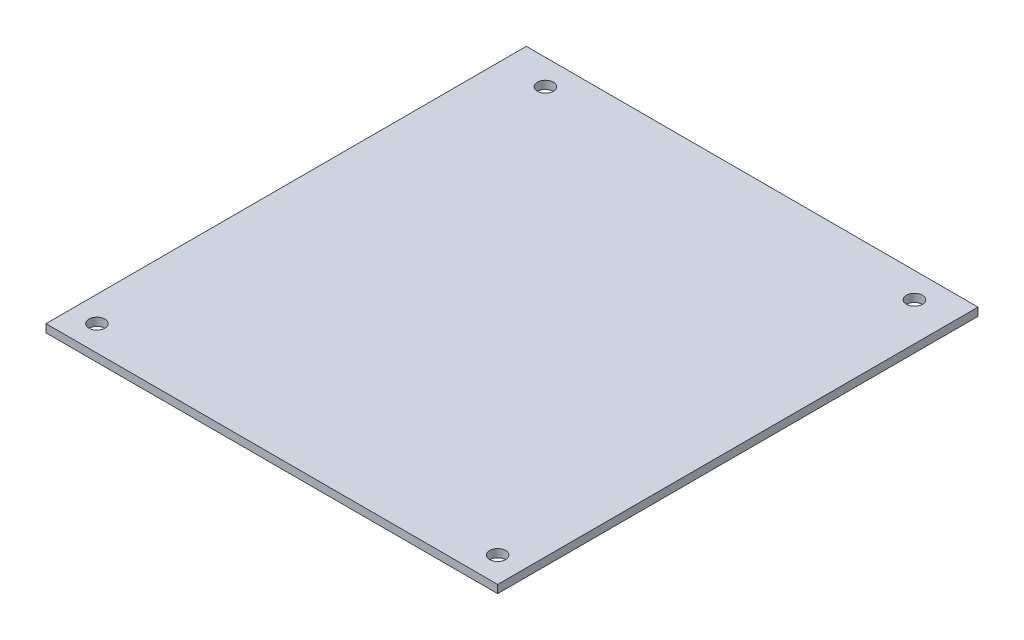
ISO-10303-21;
HEADER;
FILE_DESCRIPTION(('STEP AP214'),'2;1');
FILE_NAME('part.step','',(''),(''),'','','');
FILE_SCHEMA(('AUTOMOTIVE_DESIGN { 1 0 10303 214 1 1 1 1 }'));
ENDSEC;
DATA;
#1=APPLICATION_CONTEXT('core data for automotive mechanical design processes');
#2=APPLICATION_PROTOCOL_DEFINITION('international standard','automotive_design',2000,#1);
#3=PRODUCT_CONTEXT('',#1,'mechanical');
#4=PRODUCT('Part','Part','',(#3));
#5=PRODUCT_RELATED_PRODUCT_CATEGORY('part','',(#4));
#6=PRODUCT_DEFINITION_FORMATION('','',#4);
#7=PRODUCT_DEFINITION_CONTEXT('part definition',#1,'design');
#8=PRODUCT_DEFINITION('design','',#6,#7);
#9=PRODUCT_DEFINITION_SHAPE('','',#8);
#10=(LENGTH_UNIT() NAMED_UNIT(*) SI_UNIT(.MILLI.,.METRE.));
#11=(NAMED_UNIT(*) PLANE_ANGLE_UNIT() SI_UNIT($,.RADIAN.));
#12=(NAMED_UNIT(*) SI_UNIT($,.STERADIAN.) SOLID_ANGLE_UNIT());
#13=UNCERTAINTY_MEASURE_WITH_UNIT(LENGTH_MEASURE(1.E-05),#10,'distance_accuracy_value','');
#14=(GEOMETRIC_REPRESENTATION_CONTEXT(3) GLOBAL_UNCERTAINTY_ASSIGNED_CONTEXT((#13)) GLOBAL_UNIT_ASSIGNED_CONTEXT((#10,
#11,#12)) REPRESENTATION_CONTEXT('',''));
#15=CARTESIAN_POINT('',(0.,0.,0.));
#16=DIRECTION('',(0.,0.,1.));
#17=DIRECTION('',(1.,0.,0.));
#18=AXIS2_PLACEMENT_3D('',#15,#16,#17);
#19=CARTESIAN_POINT('',(0.,17.5,0.));
#20=DIRECTION('',(0.,-1.,0.));
#21=DIRECTION('',(0.,0.,-1.));
#22=AXIS2_PLACEMENT_3D('',#19,#20,#21);
#23=PLANE('',#22);
#24=DIRECTION('',(-1.,0.,0.));
#25=VECTOR('',#24,1.);
#26=CARTESIAN_POINT('',(46.2999999999755,17.5,47.945));
#27=LINE('',#26,#25);
#28=CARTESIAN_POINT('',(45.085,17.5,47.945));
#29=VERTEX_POINT('',#28);
#30=CARTESIAN_POINT('',(-45.085,17.5,47.945));
#31=VERTEX_POINT('',#30);
#32=EDGE_CURVE('E96',#29,#31,#27,.T.);
#33=ORIENTED_EDGE('',*,*,#32,.F.);
#34=DIRECTION('',(0.,0.,-1.));
#35=VECTOR('',#34,1.);
#36=CARTESIAN_POINT('',(45.085,17.5,46.3));
#37=LINE('',#36,#35);
#38=CARTESIAN_POINT('',(45.085,17.5,-47.9449999999993));
#39=VERTEX_POINT('',#38);
#40=EDGE_CURVE('E86',#29,#39,#37,.T.);
#41=ORIENTED_EDGE('',*,*,#40,.T.);
#42=DIRECTION('',(-1.,0.,0.));
#43=VECTOR('',#42,1.);
#44=CARTESIAN_POINT('',(46.2999999999763,17.5,-47.9449999999993));
#45=LINE('',#44,#43);
#46=CARTESIAN_POINT('',(-45.085,17.5,-47.945));
#47=VERTEX_POINT('',#46);
#48=EDGE_CURVE('E81',#39,#47,#45,.T.);
#49=ORIENTED_EDGE('',*,*,#48,.T.);
#50=DIRECTION('',(0.,0.,-1.));
#51=VECTOR('',#50,1.);
#52=CARTESIAN_POINT('',(-45.085,17.5,46.3));
#53=LINE('',#52,#51);
#54=EDGE_CURVE('E85',#31,#47,#53,.T.);
#55=ORIENTED_EDGE('',*,*,#54,.F.);
#56=EDGE_LOOP('',(#33,#41,#49,#55));
#57=FACE_BOUND('',#56,.T.);
#58=CARTESIAN_POINT('',(-36.195,17.5,-42.865));
#59=DIRECTION('',(0.,1.,0.));
#60=DIRECTION('',(0.,0.,1.));
#61=AXIS2_PLACEMENT_3D('',#58,#59,#60);
#62=CIRCLE('',#61,1.59);
#63=CARTESIAN_POINT('',(-36.195,17.5,-41.275));
#64=VERTEX_POINT('',#63);
#65=EDGE_CURVE('E106',#64,#64,#62,.T.);
#66=ORIENTED_EDGE('',*,*,#65,.F.);
#67=EDGE_LOOP('',(#66));
#68=FACE_BOUND('',#67,.T.);
#69=CARTESIAN_POINT('',(-40.005,17.5,42.865));
#70=DIRECTION('',(0.,1.,0.));
#71=DIRECTION('',(0.,0.,1.));
#72=AXIS2_PLACEMENT_3D('',#69,#70,#71);
#73=CIRCLE('',#72,1.59);
#74=CARTESIAN_POINT('',(-40.005,17.5,44.455));
#75=VERTEX_POINT('',#74);
#76=EDGE_CURVE('E149',#75,#75,#73,.T.);
#77=ORIENTED_EDGE('',*,*,#76,.F.);
#78=EDGE_LOOP('',(#77));
#79=FACE_BOUND('',#78,.T.);
#80=CARTESIAN_POINT('',(37.465,17.5,-42.865));
#81=DIRECTION('',(0.,1.,0.));
#82=DIRECTION('',(0.,0.,1.));
#83=AXIS2_PLACEMENT_3D('',#80,#81,#82);
#84=CIRCLE('',#83,1.59);
#85=CARTESIAN_POINT('',(37.465,17.5,-41.275));
#86=VERTEX_POINT('',#85);
#87=EDGE_CURVE('E156',#86,#86,#84,.T.);
#88=ORIENTED_EDGE('',*,*,#87,.F.);
#89=EDGE_LOOP('',(#88));
#90=FACE_BOUND('',#89,.T.);
#91=CARTESIAN_POINT('',(40.005,17.5,42.865));
#92=DIRECTION('',(0.,1.,0.));
#93=DIRECTION('',(0.,0.,1.));
#94=AXIS2_PLACEMENT_3D('',#91,#92,#93);
#95=CIRCLE('',#94,1.59);
#96=CARTESIAN_POINT('',(40.005,17.5,44.455));
#97=VERTEX_POINT('',#96);
#98=EDGE_CURVE('E161',#97,#97,#95,.T.);
#99=ORIENTED_EDGE('',*,*,#98,.F.);
#100=EDGE_LOOP('',(#99));
#101=FACE_BOUND('',#100,.T.);
#102=ADVANCED_FACE('F35',(#57,#68,#79,#90,#101),#23,.F.);
#103=CARTESIAN_POINT('',(0.,15.9,0.));
#104=DIRECTION('',(0.,-1.,0.));
#105=DIRECTION('',(0.,0.,-1.));
#106=AXIS2_PLACEMENT_3D('',#103,#104,#105);
#107=PLANE('',#106);
#108=CARTESIAN_POINT('',(37.465,15.9,-42.865));
#109=DIRECTION('',(0.,1.,0.));
#110=DIRECTION('',(0.,0.,1.));
#111=AXIS2_PLACEMENT_3D('',#108,#109,#110);
#112=CIRCLE('',#111,1.59);
#113=CARTESIAN_POINT('',(37.465,15.9,-41.275));
#114=VERTEX_POINT('',#113);
#115=EDGE_CURVE('E158',#114,#114,#112,.T.);
#116=ORIENTED_EDGE('',*,*,#115,.T.);
#117=EDGE_LOOP('',(#116));
#118=FACE_BOUND('',#117,.T.);
#119=CARTESIAN_POINT('',(-36.195,15.9,-42.865));
#120=DIRECTION('',(0.,1.,0.));
#121=DIRECTION('',(0.,0.,1.));
#122=AXIS2_PLACEMENT_3D('',#119,#120,#121);
#123=CIRCLE('',#122,1.59);
#124=CARTESIAN_POINT('',(-36.195,15.9,-41.275));
#125=VERTEX_POINT('',#124);
#126=EDGE_CURVE('E147',#125,#125,#123,.T.);
#127=ORIENTED_EDGE('',*,*,#126,.T.);
#128=EDGE_LOOP('',(#127));
#129=FACE_BOUND('',#128,.T.);
#130=DIRECTION('',(-1.,0.,0.));
#131=VECTOR('',#130,1.);
#132=CARTESIAN_POINT('',(46.2999999999755,15.9,47.945));
#133=LINE('',#132,#131);
#134=CARTESIAN_POINT('',(45.085,15.9,47.945));
#135=VERTEX_POINT('',#134);
#136=CARTESIAN_POINT('',(-45.085,15.9,47.945));
#137=VERTEX_POINT('',#136);
#138=EDGE_CURVE('E102',#135,#137,#133,.T.);
#139=ORIENTED_EDGE('',*,*,#138,.T.);
#140=DIRECTION('',(0.,0.,-1.));
#141=VECTOR('',#140,1.);
#142=CARTESIAN_POINT('',(-45.085,15.9,46.3));
#143=LINE('',#142,#141);
#144=CARTESIAN_POINT('',(-45.085,15.9,-47.945));
#145=VERTEX_POINT('',#144);
#146=EDGE_CURVE('E105',#137,#145,#143,.T.);
#147=ORIENTED_EDGE('',*,*,#146,.T.);
#148=DIRECTION('',(-1.,0.,0.));
#149=VECTOR('',#148,1.);
#150=CARTESIAN_POINT('',(46.2999999999763,15.9,-47.9449999999993));
#151=LINE('',#150,#149);
#152=CARTESIAN_POINT('',(45.085,15.9,-47.9449999999993));
#153=VERTEX_POINT('',#152);
#154=EDGE_CURVE('E93',#153,#145,#151,.T.);
#155=ORIENTED_EDGE('',*,*,#154,.F.);
#156=DIRECTION('',(0.,0.,-1.));
#157=VECTOR('',#156,1.);
#158=CARTESIAN_POINT('',(45.085,15.9,46.3));
#159=LINE('',#158,#157);
#160=EDGE_CURVE('E69',#135,#153,#159,.T.);
#161=ORIENTED_EDGE('',*,*,#160,.F.);
#162=EDGE_LOOP('',(#139,#147,#155,#161));
#163=FACE_BOUND('',#162,.T.);
#164=CARTESIAN_POINT('',(-40.005,15.9,42.865));
#165=DIRECTION('',(0.,1.,0.));
#166=DIRECTION('',(0.,0.,1.));
#167=AXIS2_PLACEMENT_3D('',#164,#165,#166);
#168=CIRCLE('',#167,1.59);
#169=CARTESIAN_POINT('',(-40.005,15.9,44.455));
#170=VERTEX_POINT('',#169);
#171=EDGE_CURVE('E152',#170,#170,#168,.T.);
#172=ORIENTED_EDGE('',*,*,#171,.T.);
#173=EDGE_LOOP('',(#172));
#174=FACE_BOUND('',#173,.T.);
#175=CARTESIAN_POINT('',(40.005,15.9,42.865));
#176=DIRECTION('',(0.,1.,0.));
#177=DIRECTION('',(0.,0.,1.));
#178=AXIS2_PLACEMENT_3D('',#175,#176,#177);
#179=CIRCLE('',#178,1.59);
#180=CARTESIAN_POINT('',(40.005,15.9,44.455));
#181=VERTEX_POINT('',#180);
#182=EDGE_CURVE('E164',#181,#181,#179,.T.);
#183=ORIENTED_EDGE('',*,*,#182,.T.);
#184=EDGE_LOOP('',(#183));
#185=FACE_BOUND('',#184,.T.);
#186=ADVANCED_FACE('F111',(#118,#129,#163,#174,#185),#107,.T.);
#187=CARTESIAN_POINT('',(46.2999999999755,17.5,47.945));
#188=DIRECTION('',(0.,0.,1.));
#189=DIRECTION('',(1.,0.,0.));
#190=AXIS2_PLACEMENT_3D('',#187,#188,#189);
#191=PLANE('',#190);
#192=ORIENTED_EDGE('',*,*,#138,.F.);
#193=DIRECTION('',(0.,-1.,0.));
#194=VECTOR('',#193,1.);
#195=CARTESIAN_POINT('',(45.085,17.5,47.945));
#196=LINE('',#195,#194);
#197=EDGE_CURVE('E11',#29,#135,#196,.T.);
#198=ORIENTED_EDGE('',*,*,#197,.F.);
#199=ORIENTED_EDGE('',*,*,#32,.T.);
#200=DIRECTION('',(0.,-1.,0.));
#201=VECTOR('',#200,1.);
#202=CARTESIAN_POINT('',(-45.085,17.5,47.945));
#203=LINE('',#202,#201);
#204=EDGE_CURVE('E39',#31,#137,#203,.T.);
#205=ORIENTED_EDGE('',*,*,#204,.T.);
#206=EDGE_LOOP('',(#192,#198,#199,#205));
#207=FACE_BOUND('',#206,.T.);
#208=ADVANCED_FACE('F37',(#207),#191,.T.);
#209=CARTESIAN_POINT('',(45.085,17.5,46.3));
#210=DIRECTION('',(-1.,0.,0.));
#211=DIRECTION('',(0.,0.,1.));
#212=AXIS2_PLACEMENT_3D('',#209,#210,#211);
#213=PLANE('',#212);
#214=ORIENTED_EDGE('',*,*,#160,.T.);
#215=DIRECTION('',(0.,-1.,0.));
#216=VECTOR('',#215,1.);
#217=CARTESIAN_POINT('',(45.085,17.5,-47.9449999999993));
#218=LINE('',#217,#216);
#219=EDGE_CURVE('E45',#39,#153,#218,.T.);
#220=ORIENTED_EDGE('',*,*,#219,.F.);
#221=ORIENTED_EDGE('',*,*,#40,.F.);
#222=ORIENTED_EDGE('',*,*,#197,.T.);
#223=EDGE_LOOP('',(#214,#220,#221,#222));
#224=FACE_BOUND('',#223,.T.);
#225=ADVANCED_FACE('F114',(#224),#213,.F.);
#226=CARTESIAN_POINT('',(46.2999999999763,17.5,-47.9449999999993));
#227=DIRECTION('',(0.,0.,1.));
#228=DIRECTION('',(1.,0.,0.));
#229=AXIS2_PLACEMENT_3D('',#226,#227,#228);
#230=PLANE('',#229);
#231=ORIENTED_EDGE('',*,*,#154,.T.);
#232=DIRECTION('',(0.,-1.,0.));
#233=VECTOR('',#232,1.);
#234=CARTESIAN_POINT('',(-45.085,17.5,-47.945));
#235=LINE('',#234,#233);
#236=EDGE_CURVE('E90',#47,#145,#235,.T.);
#237=ORIENTED_EDGE('',*,*,#236,.F.);
#238=ORIENTED_EDGE('',*,*,#48,.F.);
#239=ORIENTED_EDGE('',*,*,#219,.T.);
#240=EDGE_LOOP('',(#231,#237,#238,#239));
#241=FACE_BOUND('',#240,.T.);
#242=ADVANCED_FACE('F91',(#241),#230,.F.);
#243=CARTESIAN_POINT('',(-45.085,17.5,46.3));
#244=DIRECTION('',(-1.,0.,0.));
#245=DIRECTION('',(0.,0.,1.));
#246=AXIS2_PLACEMENT_3D('',#243,#244,#245);
#247=PLANE('',#246);
#248=ORIENTED_EDGE('',*,*,#146,.F.);
#249=ORIENTED_EDGE('',*,*,#204,.F.);
#250=ORIENTED_EDGE('',*,*,#54,.T.);
#251=ORIENTED_EDGE('',*,*,#236,.T.);
#252=EDGE_LOOP('',(#248,#249,#250,#251));
#253=FACE_BOUND('',#252,.T.);
#254=ADVANCED_FACE('F95',(#253),#247,.T.);
#255=CARTESIAN_POINT('',(-36.195,17.5,-42.865));
#256=DIRECTION('',(0.,-1.,0.));
#257=DIRECTION('',(0.,0.,-1.));
#258=AXIS2_PLACEMENT_3D('',#255,#256,#257);
#259=CYLINDRICAL_SURFACE('',#258,1.59);
#260=ORIENTED_EDGE('',*,*,#65,.T.);
#261=EDGE_LOOP('',(#260));
#262=FACE_BOUND('',#261,.T.);
#263=ORIENTED_EDGE('',*,*,#126,.F.);
#264=EDGE_LOOP('',(#263));
#265=FACE_BOUND('',#264,.T.);
#266=ADVANCED_FACE('F127',(#262,#265),#259,.F.);
#267=CARTESIAN_POINT('',(-40.005,17.5,42.865));
#268=DIRECTION('',(0.,-1.,0.));
#269=DIRECTION('',(0.,0.,-1.));
#270=AXIS2_PLACEMENT_3D('',#267,#268,#269);
#271=CYLINDRICAL_SURFACE('',#270,1.59);
#272=ORIENTED_EDGE('',*,*,#76,.T.);
#273=EDGE_LOOP('',(#272));
#274=FACE_BOUND('',#273,.T.);
#275=ORIENTED_EDGE('',*,*,#171,.F.);
#276=EDGE_LOOP('',(#275));
#277=FACE_BOUND('',#276,.T.);
#278=ADVANCED_FACE('F135',(#274,#277),#271,.F.);
#279=CARTESIAN_POINT('',(37.465,17.5,-42.865));
#280=DIRECTION('',(0.,-1.,0.));
#281=DIRECTION('',(0.,0.,-1.));
#282=AXIS2_PLACEMENT_3D('',#279,#280,#281);
#283=CYLINDRICAL_SURFACE('',#282,1.59);
#284=ORIENTED_EDGE('',*,*,#87,.T.);
#285=EDGE_LOOP('',(#284));
#286=FACE_BOUND('',#285,.T.);
#287=ORIENTED_EDGE('',*,*,#115,.F.);
#288=EDGE_LOOP('',(#287));
#289=FACE_BOUND('',#288,.T.);
#290=ADVANCED_FACE('F140',(#286,#289),#283,.F.);
#291=CARTESIAN_POINT('',(40.005,17.5,42.865));
#292=DIRECTION('',(0.,-1.,0.));
#293=DIRECTION('',(0.,0.,-1.));
#294=AXIS2_PLACEMENT_3D('',#291,#292,#293);
#295=CYLINDRICAL_SURFACE('',#294,1.59);
#296=ORIENTED_EDGE('',*,*,#98,.T.);
#297=EDGE_LOOP('',(#296));
#298=FACE_BOUND('',#297,.T.);
#299=ORIENTED_EDGE('',*,*,#182,.F.);
#300=EDGE_LOOP('',(#299));
#301=FACE_BOUND('',#300,.T.);
#302=ADVANCED_FACE('F170',(#298,#301),#295,.F.);
#303=CLOSED_SHELL('',(#102,#186,#208,#225,#242,#254,#266,#278,#290,#302));
#304=MANIFOLD_SOLID_BREP('B2',#303);
#305=ADVANCED_BREP_SHAPE_REPRESENTATION('',(#18,#304),#14);
#306=SHAPE_DEFINITION_REPRESENTATION(#9,#305);
ENDSEC;
END-ISO-10303-21;
